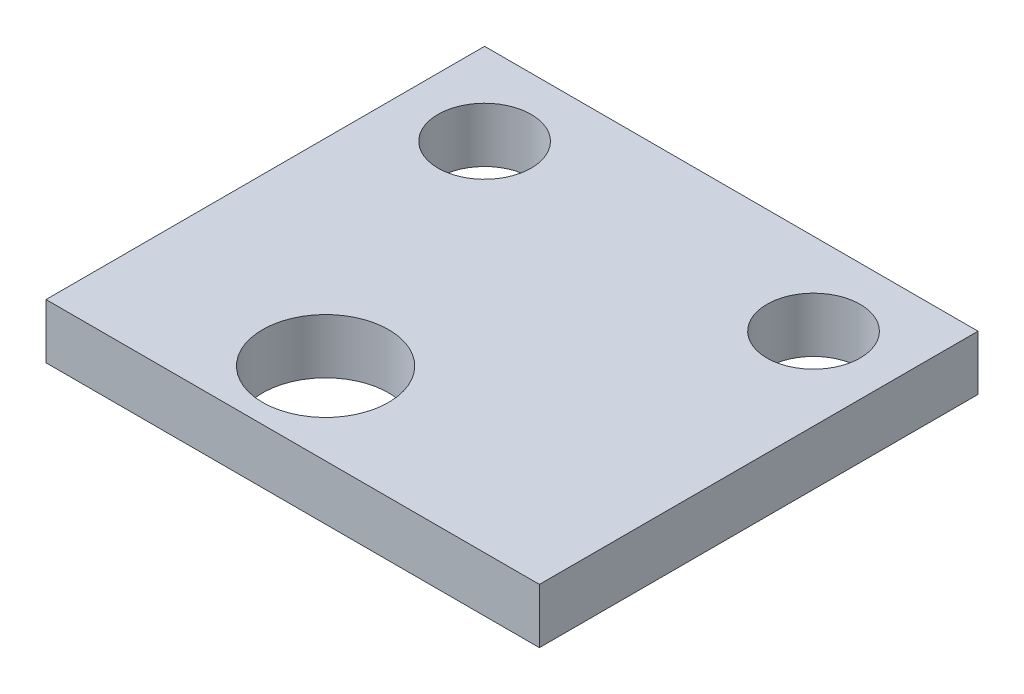
ISO-10303-21;
HEADER;
FILE_DESCRIPTION(('STEP AP214'),'2;1');
FILE_NAME('part.step','',(''),(''),'','','');
FILE_SCHEMA(('AUTOMOTIVE_DESIGN { 1 0 10303 214 1 1 1 1 }'));
ENDSEC;
DATA;
#1=APPLICATION_CONTEXT('core data for automotive mechanical design processes');
#2=APPLICATION_PROTOCOL_DEFINITION('international standard','automotive_design',2000,#1);
#3=PRODUCT_CONTEXT('',#1,'mechanical');
#4=PRODUCT('Part','Part','',(#3));
#5=PRODUCT_RELATED_PRODUCT_CATEGORY('part','',(#4));
#6=PRODUCT_DEFINITION_FORMATION('','',#4);
#7=PRODUCT_DEFINITION_CONTEXT('part definition',#1,'design');
#8=PRODUCT_DEFINITION('design','',#6,#7);
#9=PRODUCT_DEFINITION_SHAPE('','',#8);
#10=(LENGTH_UNIT() NAMED_UNIT(*) SI_UNIT(.MILLI.,.METRE.));
#11=(NAMED_UNIT(*) PLANE_ANGLE_UNIT() SI_UNIT($,.RADIAN.));
#12=(NAMED_UNIT(*) SI_UNIT($,.STERADIAN.) SOLID_ANGLE_UNIT());
#13=UNCERTAINTY_MEASURE_WITH_UNIT(LENGTH_MEASURE(1.E-05),#10,'distance_accuracy_value','');
#14=(GEOMETRIC_REPRESENTATION_CONTEXT(3) GLOBAL_UNCERTAINTY_ASSIGNED_CONTEXT((#13)) GLOBAL_UNIT_ASSIGNED_CONTEXT((#10,
#11,#12)) REPRESENTATION_CONTEXT('',''));
#15=CARTESIAN_POINT('',(0.,0.,0.));
#16=DIRECTION('',(0.,0.,1.));
#17=DIRECTION('',(1.,0.,0.));
#18=AXIS2_PLACEMENT_3D('',#15,#16,#17);
#19=CARTESIAN_POINT('',(0.,1.,-8.));
#20=DIRECTION('',(0.,-1.,0.));
#21=DIRECTION('',(0.,0.,-1.));
#22=AXIS2_PLACEMENT_3D('',#19,#20,#21);
#23=PLANE('',#22);
#24=CARTESIAN_POINT('',(7.5,1.,-6.5));
#25=DIRECTION('',(0.,1.,0.));
#26=DIRECTION('',(0.,0.,1.));
#27=AXIS2_PLACEMENT_3D('',#24,#25,#26);
#28=CIRCLE('',#27,0.85);
#29=CARTESIAN_POINT('',(7.5,1.,-5.65));
#30=VERTEX_POINT('',#29);
#31=EDGE_CURVE('E113',#30,#30,#28,.T.);
#32=ORIENTED_EDGE('',*,*,#31,.F.);
#33=EDGE_LOOP('',(#32));
#34=FACE_BOUND('',#33,.T.);
#35=DIRECTION('',(0.,0.,1.));
#36=VECTOR('',#35,1.);
#37=CARTESIAN_POINT('',(0.,1.,0.));
#38=LINE('',#37,#36);
#39=CARTESIAN_POINT('',(0.,1.,-8.));
#40=VERTEX_POINT('',#39);
#41=CARTESIAN_POINT('',(0.,1.,0.));
#42=VERTEX_POINT('',#41);
#43=EDGE_CURVE('E83',#40,#42,#38,.T.);
#44=ORIENTED_EDGE('',*,*,#43,.T.);
#45=DIRECTION('',(1.,0.,0.));
#46=VECTOR('',#45,1.);
#47=CARTESIAN_POINT('',(0.,1.,0.));
#48=LINE('',#47,#46);
#49=CARTESIAN_POINT('',(9.,1.,0.));
#50=VERTEX_POINT('',#49);
#51=EDGE_CURVE('E78',#42,#50,#48,.T.);
#52=ORIENTED_EDGE('',*,*,#51,.T.);
#53=DIRECTION('',(0.,0.,-1.));
#54=VECTOR('',#53,1.);
#55=CARTESIAN_POINT('',(9.,1.,0.));
#56=LINE('',#55,#54);
#57=CARTESIAN_POINT('',(9.,1.,-8.));
#58=VERTEX_POINT('',#57);
#59=EDGE_CURVE('E81',#50,#58,#56,.T.);
#60=ORIENTED_EDGE('',*,*,#59,.T.);
#61=DIRECTION('',(-1.,0.,0.));
#62=VECTOR('',#61,1.);
#63=CARTESIAN_POINT('',(0.,1.,-8.));
#64=LINE('',#63,#62);
#65=EDGE_CURVE('E48',#58,#40,#64,.T.);
#66=ORIENTED_EDGE('',*,*,#65,.T.);
#67=EDGE_LOOP('',(#44,#52,#60,#66));
#68=FACE_BOUND('',#67,.T.);
#69=CARTESIAN_POINT('',(1.5,1.,-6.5));
#70=DIRECTION('',(0.,1.,0.));
#71=DIRECTION('',(0.,0.,1.));
#72=AXIS2_PLACEMENT_3D('',#69,#70,#71);
#73=CIRCLE('',#72,0.85);
#74=CARTESIAN_POINT('',(1.5,1.,-5.65));
#75=VERTEX_POINT('',#74);
#76=EDGE_CURVE('E98',#75,#75,#73,.T.);
#77=ORIENTED_EDGE('',*,*,#76,.F.);
#78=EDGE_LOOP('',(#77));
#79=FACE_BOUND('',#78,.T.);
#80=CARTESIAN_POINT('',(3.6,1.,-1.5));
#81=DIRECTION('',(0.,1.,0.));
#82=DIRECTION('',(0.,0.,1.));
#83=AXIS2_PLACEMENT_3D('',#80,#81,#82);
#84=CIRCLE('',#83,1.15);
#85=CARTESIAN_POINT('',(3.6,1.,-0.350000000000001));
#86=VERTEX_POINT('',#85);
#87=EDGE_CURVE('E119',#86,#86,#84,.T.);
#88=ORIENTED_EDGE('',*,*,#87,.F.);
#89=EDGE_LOOP('',(#88));
#90=FACE_BOUND('',#89,.T.);
#91=ADVANCED_FACE('F31',(#34,#68,#79,#90),#23,.F.);
#92=CARTESIAN_POINT('',(0.,0.,-8.));
#93=DIRECTION('',(0.,-1.,0.));
#94=DIRECTION('',(0.,0.,-1.));
#95=AXIS2_PLACEMENT_3D('',#92,#93,#94);
#96=PLANE('',#95);
#97=CARTESIAN_POINT('',(7.5,0.,-6.5));
#98=DIRECTION('',(0.,1.,0.));
#99=DIRECTION('',(0.,0.,1.));
#100=AXIS2_PLACEMENT_3D('',#97,#98,#99);
#101=CIRCLE('',#100,0.85);
#102=CARTESIAN_POINT('',(7.5,0.,-5.65));
#103=VERTEX_POINT('',#102);
#104=EDGE_CURVE('E116',#103,#103,#101,.T.);
#105=ORIENTED_EDGE('',*,*,#104,.T.);
#106=EDGE_LOOP('',(#105));
#107=FACE_BOUND('',#106,.T.);
#108=DIRECTION('',(0.,0.,1.));
#109=VECTOR('',#108,1.);
#110=CARTESIAN_POINT('',(0.,0.,0.));
#111=LINE('',#110,#109);
#112=CARTESIAN_POINT('',(0.,0.,-8.));
#113=VERTEX_POINT('',#112);
#114=CARTESIAN_POINT('',(0.,0.,0.));
#115=VERTEX_POINT('',#114);
#116=EDGE_CURVE('E95',#113,#115,#111,.T.);
#117=ORIENTED_EDGE('',*,*,#116,.F.);
#118=DIRECTION('',(-1.,0.,0.));
#119=VECTOR('',#118,1.);
#120=CARTESIAN_POINT('',(0.,0.,-8.));
#121=LINE('',#120,#119);
#122=CARTESIAN_POINT('',(9.,0.,-8.));
#123=VERTEX_POINT('',#122);
#124=EDGE_CURVE('E71',#123,#113,#121,.T.);
#125=ORIENTED_EDGE('',*,*,#124,.F.);
#126=DIRECTION('',(0.,0.,-1.));
#127=VECTOR('',#126,1.);
#128=CARTESIAN_POINT('',(9.,0.,0.));
#129=LINE('',#128,#127);
#130=CARTESIAN_POINT('',(9.,0.,0.));
#131=VERTEX_POINT('',#130);
#132=EDGE_CURVE('E65',#131,#123,#129,.T.);
#133=ORIENTED_EDGE('',*,*,#132,.F.);
#134=DIRECTION('',(1.,0.,0.));
#135=VECTOR('',#134,1.);
#136=CARTESIAN_POINT('',(0.,0.,0.));
#137=LINE('',#136,#135);
#138=EDGE_CURVE('E87',#115,#131,#137,.T.);
#139=ORIENTED_EDGE('',*,*,#138,.F.);
#140=EDGE_LOOP('',(#117,#125,#133,#139));
#141=FACE_BOUND('',#140,.T.);
#142=CARTESIAN_POINT('',(1.5,0.,-6.5));
#143=DIRECTION('',(0.,1.,0.));
#144=DIRECTION('',(0.,0.,1.));
#145=AXIS2_PLACEMENT_3D('',#142,#143,#144);
#146=CIRCLE('',#145,0.85);
#147=CARTESIAN_POINT('',(1.5,0.,-5.65));
#148=VERTEX_POINT('',#147);
#149=EDGE_CURVE('E110',#148,#148,#146,.T.);
#150=ORIENTED_EDGE('',*,*,#149,.T.);
#151=EDGE_LOOP('',(#150));
#152=FACE_BOUND('',#151,.T.);
#153=CARTESIAN_POINT('',(3.6,0.,-1.5));
#154=DIRECTION('',(0.,1.,0.));
#155=DIRECTION('',(0.,0.,1.));
#156=AXIS2_PLACEMENT_3D('',#153,#154,#155);
#157=CIRCLE('',#156,1.15);
#158=CARTESIAN_POINT('',(3.6,0.,-0.350000000000001));
#159=VERTEX_POINT('',#158);
#160=EDGE_CURVE('E122',#159,#159,#157,.T.);
#161=ORIENTED_EDGE('',*,*,#160,.T.);
#162=EDGE_LOOP('',(#161));
#163=FACE_BOUND('',#162,.T.);
#164=ADVANCED_FACE('F106',(#107,#141,#152,#163),#96,.T.);
#165=CARTESIAN_POINT('',(0.,1.,0.));
#166=DIRECTION('',(1.,0.,0.));
#167=DIRECTION('',(0.,0.,-1.));
#168=AXIS2_PLACEMENT_3D('',#165,#166,#167);
#169=PLANE('',#168);
#170=ORIENTED_EDGE('',*,*,#116,.T.);
#171=DIRECTION('',(0.,-1.,0.));
#172=VECTOR('',#171,1.);
#173=CARTESIAN_POINT('',(0.,1.,0.));
#174=LINE('',#173,#172);
#175=EDGE_CURVE('E11',#42,#115,#174,.T.);
#176=ORIENTED_EDGE('',*,*,#175,.F.);
#177=ORIENTED_EDGE('',*,*,#43,.F.);
#178=DIRECTION('',(0.,-1.,0.));
#179=VECTOR('',#178,1.);
#180=CARTESIAN_POINT('',(0.,1.,-8.));
#181=LINE('',#180,#179);
#182=EDGE_CURVE('E91',#40,#113,#181,.T.);
#183=ORIENTED_EDGE('',*,*,#182,.T.);
#184=EDGE_LOOP('',(#170,#176,#177,#183));
#185=FACE_BOUND('',#184,.T.);
#186=ADVANCED_FACE('F33',(#185),#169,.F.);
#187=CARTESIAN_POINT('',(0.,1.,0.));
#188=DIRECTION('',(0.,0.,-1.));
#189=DIRECTION('',(-1.,0.,0.));
#190=AXIS2_PLACEMENT_3D('',#187,#188,#189);
#191=PLANE('',#190);
#192=ORIENTED_EDGE('',*,*,#138,.T.);
#193=DIRECTION('',(0.,-1.,0.));
#194=VECTOR('',#193,1.);
#195=CARTESIAN_POINT('',(9.,1.,0.));
#196=LINE('',#195,#194);
#197=EDGE_CURVE('E40',#50,#131,#196,.T.);
#198=ORIENTED_EDGE('',*,*,#197,.F.);
#199=ORIENTED_EDGE('',*,*,#51,.F.);
#200=ORIENTED_EDGE('',*,*,#175,.T.);
#201=EDGE_LOOP('',(#192,#198,#199,#200));
#202=FACE_BOUND('',#201,.T.);
#203=ADVANCED_FACE('F86',(#202),#191,.F.);
#204=CARTESIAN_POINT('',(9.,1.,0.));
#205=DIRECTION('',(-1.,0.,0.));
#206=DIRECTION('',(0.,0.,1.));
#207=AXIS2_PLACEMENT_3D('',#204,#205,#206);
#208=PLANE('',#207);
#209=ORIENTED_EDGE('',*,*,#132,.T.);
#210=DIRECTION('',(0.,-1.,0.));
#211=VECTOR('',#210,1.);
#212=CARTESIAN_POINT('',(9.,1.,-8.));
#213=LINE('',#212,#211);
#214=EDGE_CURVE('E88',#58,#123,#213,.T.);
#215=ORIENTED_EDGE('',*,*,#214,.F.);
#216=ORIENTED_EDGE('',*,*,#59,.F.);
#217=ORIENTED_EDGE('',*,*,#197,.T.);
#218=EDGE_LOOP('',(#209,#215,#216,#217));
#219=FACE_BOUND('',#218,.T.);
#220=ADVANCED_FACE('F89',(#219),#208,.F.);
#221=CARTESIAN_POINT('',(0.,1.,-8.));
#222=DIRECTION('',(0.,0.,1.));
#223=DIRECTION('',(1.,0.,0.));
#224=AXIS2_PLACEMENT_3D('',#221,#222,#223);
#225=PLANE('',#224);
#226=ORIENTED_EDGE('',*,*,#124,.T.);
#227=ORIENTED_EDGE('',*,*,#182,.F.);
#228=ORIENTED_EDGE('',*,*,#65,.F.);
#229=ORIENTED_EDGE('',*,*,#214,.T.);
#230=EDGE_LOOP('',(#226,#227,#228,#229));
#231=FACE_BOUND('',#230,.T.);
#232=ADVANCED_FACE('F103',(#231),#225,.F.);
#233=CARTESIAN_POINT('',(1.5,1.,-6.5));
#234=DIRECTION('',(0.,-1.,0.));
#235=DIRECTION('',(0.,0.,-1.));
#236=AXIS2_PLACEMENT_3D('',#233,#234,#235);
#237=CYLINDRICAL_SURFACE('',#236,0.85);
#238=ORIENTED_EDGE('',*,*,#76,.T.);
#239=EDGE_LOOP('',(#238));
#240=FACE_BOUND('',#239,.T.);
#241=ORIENTED_EDGE('',*,*,#149,.F.);
#242=EDGE_LOOP('',(#241));
#243=FACE_BOUND('',#242,.T.);
#244=ADVANCED_FACE('F141',(#240,#243),#237,.F.);
#245=CARTESIAN_POINT('',(7.5,1.,-6.5));
#246=DIRECTION('',(0.,-1.,0.));
#247=DIRECTION('',(0.,0.,-1.));
#248=AXIS2_PLACEMENT_3D('',#245,#246,#247);
#249=CYLINDRICAL_SURFACE('',#248,0.85);
#250=ORIENTED_EDGE('',*,*,#31,.T.);
#251=EDGE_LOOP('',(#250));
#252=FACE_BOUND('',#251,.T.);
#253=ORIENTED_EDGE('',*,*,#104,.F.);
#254=EDGE_LOOP('',(#253));
#255=FACE_BOUND('',#254,.T.);
#256=ADVANCED_FACE('F187',(#252,#255),#249,.F.);
#257=CARTESIAN_POINT('',(3.6,1.,-1.5));
#258=DIRECTION('',(0.,-1.,0.));
#259=DIRECTION('',(0.,0.,-1.));
#260=AXIS2_PLACEMENT_3D('',#257,#258,#259);
#261=CYLINDRICAL_SURFACE('',#260,1.15);
#262=ORIENTED_EDGE('',*,*,#87,.T.);
#263=EDGE_LOOP('',(#262));
#264=FACE_BOUND('',#263,.T.);
#265=ORIENTED_EDGE('',*,*,#160,.F.);
#266=EDGE_LOOP('',(#265));
#267=FACE_BOUND('',#266,.T.);
#268=ADVANCED_FACE('F128',(#264,#267),#261,.F.);
#269=CLOSED_SHELL('',(#91,#164,#186,#203,#220,#232,#244,#256,#268));
#270=MANIFOLD_SOLID_BREP('B2',#269);
#271=ADVANCED_BREP_SHAPE_REPRESENTATION('',(#18,#270),#14);
#272=SHAPE_DEFINITION_REPRESENTATION(#9,#271);
ENDSEC;
END-ISO-10303-21;
